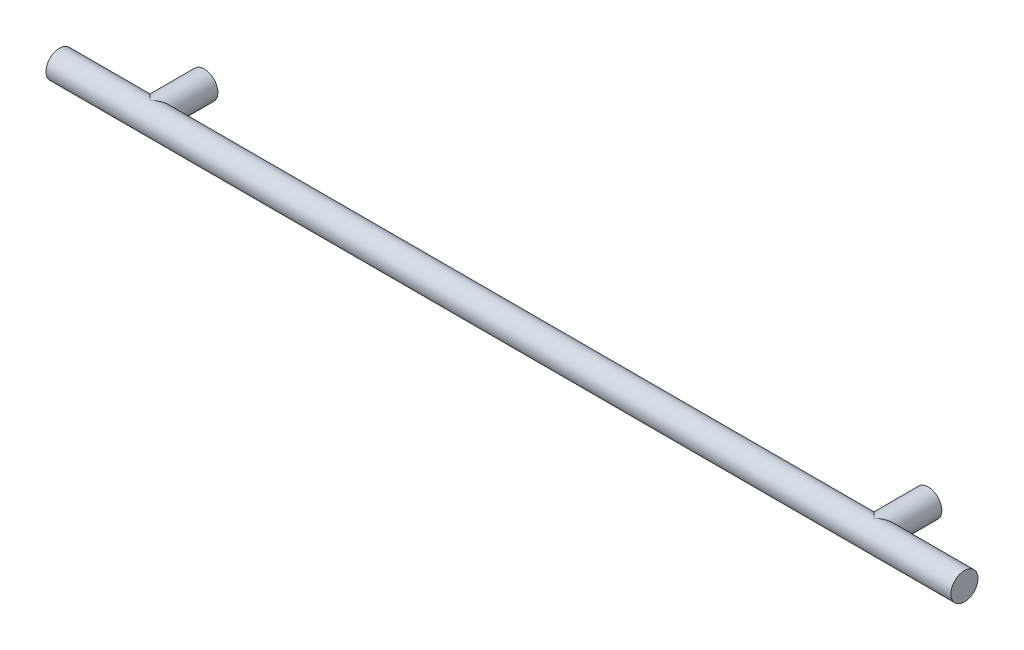
ISO-10303-21;
HEADER;
FILE_DESCRIPTION(('STEP AP214'),'2;1');
FILE_NAME('part.step','',(''),(''),'','','');
FILE_SCHEMA(('AUTOMOTIVE_DESIGN { 1 0 10303 214 1 1 1 1 }'));
ENDSEC;
DATA;
#1=APPLICATION_CONTEXT('core data for automotive mechanical design processes');
#2=APPLICATION_PROTOCOL_DEFINITION('international standard','automotive_design',2000,#1);
#3=PRODUCT_CONTEXT('',#1,'mechanical');
#4=PRODUCT('Part','Part','',(#3));
#5=PRODUCT_RELATED_PRODUCT_CATEGORY('part','',(#4));
#6=PRODUCT_DEFINITION_FORMATION('','',#4);
#7=PRODUCT_DEFINITION_CONTEXT('part definition',#1,'design');
#8=PRODUCT_DEFINITION('design','',#6,#7);
#9=PRODUCT_DEFINITION_SHAPE('','',#8);
#10=(LENGTH_UNIT() NAMED_UNIT(*) SI_UNIT(.MILLI.,.METRE.));
#11=(NAMED_UNIT(*) PLANE_ANGLE_UNIT() SI_UNIT($,.RADIAN.));
#12=(NAMED_UNIT(*) SI_UNIT($,.STERADIAN.) SOLID_ANGLE_UNIT());
#13=UNCERTAINTY_MEASURE_WITH_UNIT(LENGTH_MEASURE(1.E-05),#10,'distance_accuracy_value','');
#14=(GEOMETRIC_REPRESENTATION_CONTEXT(3) GLOBAL_UNCERTAINTY_ASSIGNED_CONTEXT((#13)) GLOBAL_UNIT_ASSIGNED_CONTEXT((#10,
#11,#12)) REPRESENTATION_CONTEXT('',''));
#15=CARTESIAN_POINT('',(0.,0.,0.));
#16=DIRECTION('',(0.,0.,1.));
#17=DIRECTION('',(1.,0.,0.));
#18=AXIS2_PLACEMENT_3D('',#15,#16,#17);
#19=CARTESIAN_POINT('',(158.75,0.,19.05));
#20=DIRECTION('',(-1.,0.,0.));
#21=DIRECTION('',(0.,0.,1.));
#22=AXIS2_PLACEMENT_3D('',#19,#20,#21);
#23=CYLINDRICAL_SURFACE('',#22,4.7625);
#24=CARTESIAN_POINT('',(-127.,0.,19.05));
#25=DIRECTION('',(-0.707106781186547,0.,-0.707106781186548));
#26=DIRECTION('',(0.707106781186547,0.,-0.707106781186548));
#27=AXIS2_PLACEMENT_3D('',#24,#25,#26);
#28=ELLIPSE('',#27,6.73519209080186,4.7625);
#29=CARTESIAN_POINT('',(-127.,-4.7625,19.05));
#30=VERTEX_POINT('',#29);
#31=CARTESIAN_POINT('',(-127.,4.7625,19.05));
#32=VERTEX_POINT('',#31);
#33=EDGE_CURVE('E72',#30,#32,#28,.F.);
#34=ORIENTED_EDGE('',*,*,#33,.T.);
#35=CARTESIAN_POINT('',(-127.,0.,19.05));
#36=DIRECTION('',(0.707106781186547,0.,-0.707106781186548));
#37=DIRECTION('',(-0.707106781186547,0.,-0.707106781186548));
#38=AXIS2_PLACEMENT_3D('',#35,#36,#37);
#39=ELLIPSE('',#38,6.73519209080186,4.7625);
#40=EDGE_CURVE('E56',#32,#30,#39,.F.);
#41=ORIENTED_EDGE('',*,*,#40,.T.);
#42=EDGE_LOOP('',(#34,#41));
#43=FACE_BOUND('',#42,.T.);
#44=CARTESIAN_POINT('',(158.75,0.,19.05));
#45=DIRECTION('',(1.,0.,0.));
#46=DIRECTION('',(0.,0.,-1.));
#47=AXIS2_PLACEMENT_3D('',#44,#45,#46);
#48=CIRCLE('',#47,4.7625);
#49=CARTESIAN_POINT('',(158.75,0.,14.2875));
#50=VERTEX_POINT('',#49);
#51=EDGE_CURVE('E11',#50,#50,#48,.T.);
#52=ORIENTED_EDGE('',*,*,#51,.F.);
#53=EDGE_LOOP('',(#52));
#54=FACE_BOUND('',#53,.T.);
#55=CARTESIAN_POINT('',(-158.75,0.,19.05));
#56=DIRECTION('',(1.,0.,0.));
#57=DIRECTION('',(0.,0.,-1.));
#58=AXIS2_PLACEMENT_3D('',#55,#56,#57);
#59=CIRCLE('',#58,4.7625);
#60=CARTESIAN_POINT('',(-158.75,0.,14.2875));
#61=VERTEX_POINT('',#60);
#62=EDGE_CURVE('E39',#61,#61,#59,.T.);
#63=ORIENTED_EDGE('',*,*,#62,.T.);
#64=EDGE_LOOP('',(#63));
#65=FACE_BOUND('',#64,.T.);
#66=CARTESIAN_POINT('',(127.,0.,19.05));
#67=DIRECTION('',(-0.707106781186547,0.,-0.707106781186548));
#68=DIRECTION('',(0.707106781186547,0.,-0.707106781186548));
#69=AXIS2_PLACEMENT_3D('',#66,#67,#68);
#70=ELLIPSE('',#69,6.73519209080186,4.7625);
#71=CARTESIAN_POINT('',(127.,-4.7625,19.05));
#72=VERTEX_POINT('',#71);
#73=CARTESIAN_POINT('',(127.,4.7625,19.05));
#74=VERTEX_POINT('',#73);
#75=EDGE_CURVE('E61',#72,#74,#70,.F.);
#76=ORIENTED_EDGE('',*,*,#75,.T.);
#77=CARTESIAN_POINT('',(127.,0.,19.05));
#78=DIRECTION('',(0.707106781186547,0.,-0.707106781186548));
#79=DIRECTION('',(-0.707106781186547,0.,-0.707106781186548));
#80=AXIS2_PLACEMENT_3D('',#77,#78,#79);
#81=ELLIPSE('',#80,6.73519209080186,4.7625);
#82=EDGE_CURVE('E49',#74,#72,#81,.F.);
#83=ORIENTED_EDGE('',*,*,#82,.T.);
#84=EDGE_LOOP('',(#76,#83));
#85=FACE_BOUND('',#84,.T.);
#86=ADVANCED_FACE('F36',(#43,#54,#65,#85),#23,.T.);
#87=CARTESIAN_POINT('',(158.75,0.,19.05));
#88=DIRECTION('',(1.,0.,0.));
#89=DIRECTION('',(0.,0.,-1.));
#90=AXIS2_PLACEMENT_3D('',#87,#88,#89);
#91=PLANE('',#90);
#92=ORIENTED_EDGE('',*,*,#51,.T.);
#93=EDGE_LOOP('',(#92));
#94=FACE_BOUND('',#93,.T.);
#95=ADVANCED_FACE('F92',(#94),#91,.T.);
#96=CARTESIAN_POINT('',(-158.75,0.,19.05));
#97=DIRECTION('',(1.,0.,0.));
#98=DIRECTION('',(0.,0.,-1.));
#99=AXIS2_PLACEMENT_3D('',#96,#97,#98);
#100=PLANE('',#99);
#101=ORIENTED_EDGE('',*,*,#62,.F.);
#102=EDGE_LOOP('',(#101));
#103=FACE_BOUND('',#102,.T.);
#104=ADVANCED_FACE('F90',(#103),#100,.F.);
#105=CARTESIAN_POINT('',(-127.,0.,0.));
#106=DIRECTION('',(0.,0.,1.));
#107=DIRECTION('',(1.,0.,0.));
#108=AXIS2_PLACEMENT_3D('',#105,#106,#107);
#109=PLANE('',#108);
#110=CARTESIAN_POINT('',(-127.,0.,0.));
#111=DIRECTION('',(0.,0.,1.));
#112=DIRECTION('',(1.,0.,0.));
#113=AXIS2_PLACEMENT_3D('',#110,#111,#112);
#114=CIRCLE('',#113,4.7625);
#115=CARTESIAN_POINT('',(-122.2375,0.,0.));
#116=VERTEX_POINT('',#115);
#117=EDGE_CURVE('E69',#116,#116,#114,.T.);
#118=ORIENTED_EDGE('',*,*,#117,.F.);
#119=EDGE_LOOP('',(#118));
#120=FACE_BOUND('',#119,.T.);
#121=ADVANCED_FACE('F87',(#120),#109,.F.);
#122=CARTESIAN_POINT('',(-127.,0.,23.8145));
#123=DIRECTION('',(0.,0.,-1.));
#124=DIRECTION('',(-1.,0.,0.));
#125=AXIS2_PLACEMENT_3D('',#122,#123,#124);
#126=CYLINDRICAL_SURFACE('',#125,4.7625);
#127=ORIENTED_EDGE('',*,*,#117,.T.);
#128=EDGE_LOOP('',(#127));
#129=FACE_BOUND('',#128,.T.);
#130=ORIENTED_EDGE('',*,*,#33,.F.);
#131=ORIENTED_EDGE('',*,*,#40,.F.);
#132=EDGE_LOOP('',(#130,#131));
#133=FACE_BOUND('',#132,.T.);
#134=ADVANCED_FACE('F80',(#129,#133),#126,.T.);
#135=CARTESIAN_POINT('',(127.,0.,0.));
#136=DIRECTION('',(0.,0.,-1.));
#137=DIRECTION('',(-1.,0.,0.));
#138=AXIS2_PLACEMENT_3D('',#135,#136,#137);
#139=PLANE('',#138);
#140=CARTESIAN_POINT('',(127.,0.,0.));
#141=DIRECTION('',(0.,0.,1.));
#142=DIRECTION('',(-1.,0.,0.));
#143=AXIS2_PLACEMENT_3D('',#140,#141,#142);
#144=CIRCLE('',#143,4.7625);
#145=CARTESIAN_POINT('',(122.2375,0.,0.));
#146=VERTEX_POINT('',#145);
#147=EDGE_CURVE('E63',#146,#146,#144,.T.);
#148=ORIENTED_EDGE('',*,*,#147,.F.);
#149=EDGE_LOOP('',(#148));
#150=FACE_BOUND('',#149,.T.);
#151=ADVANCED_FACE('F78',(#150),#139,.T.);
#152=CARTESIAN_POINT('',(127.,0.,23.8145));
#153=DIRECTION('',(0.,0.,-1.));
#154=DIRECTION('',(-1.,0.,0.));
#155=AXIS2_PLACEMENT_3D('',#152,#153,#154);
#156=CYLINDRICAL_SURFACE('',#155,4.7625);
#157=ORIENTED_EDGE('',*,*,#147,.T.);
#158=EDGE_LOOP('',(#157));
#159=FACE_BOUND('',#158,.T.);
#160=ORIENTED_EDGE('',*,*,#75,.F.);
#161=ORIENTED_EDGE('',*,*,#82,.F.);
#162=EDGE_LOOP('',(#160,#161));
#163=FACE_BOUND('',#162,.T.);
#164=ADVANCED_FACE('F65',(#159,#163),#156,.T.);
#165=CLOSED_SHELL('',(#86,#95,#104,#121,#134,#151,#164));
#166=MANIFOLD_SOLID_BREP('B2',#165);
#167=ADVANCED_BREP_SHAPE_REPRESENTATION('',(#18,#166),#14);
#168=SHAPE_DEFINITION_REPRESENTATION(#9,#167);
ENDSEC;
END-ISO-10303-21;
